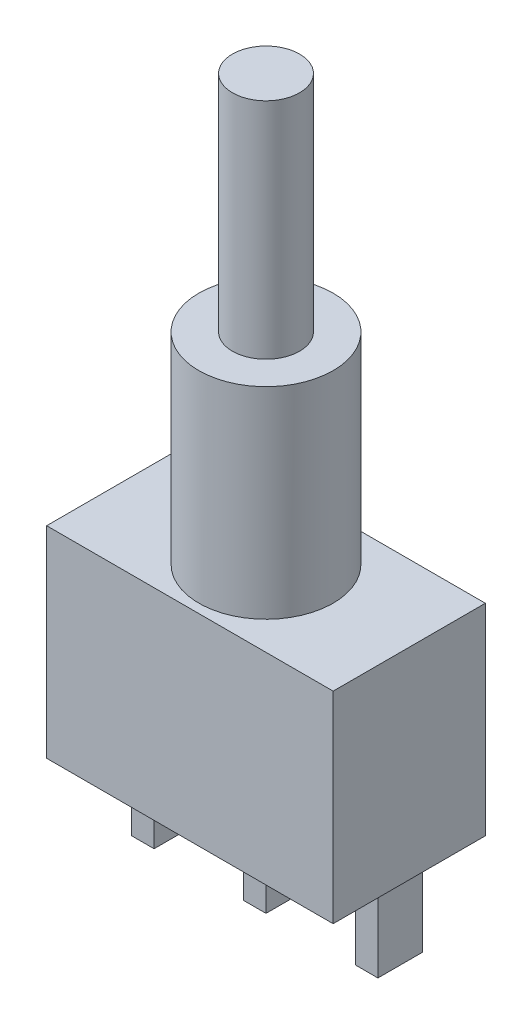
ISO-10303-21;
HEADER;
FILE_DESCRIPTION(('STEP AP214'),'2;1');
FILE_NAME('part.step','',(''),(''),'','','');
FILE_SCHEMA(('AUTOMOTIVE_DESIGN { 1 0 10303 214 1 1 1 1 }'));
ENDSEC;
DATA;
#1=APPLICATION_CONTEXT('core data for automotive mechanical design processes');
#2=APPLICATION_PROTOCOL_DEFINITION('international standard','automotive_design',2000,#1);
#3=PRODUCT_CONTEXT('',#1,'mechanical');
#4=PRODUCT('Part','Part','',(#3));
#5=PRODUCT_RELATED_PRODUCT_CATEGORY('part','',(#4));
#6=PRODUCT_DEFINITION_FORMATION('','',#4);
#7=PRODUCT_DEFINITION_CONTEXT('part definition',#1,'design');
#8=PRODUCT_DEFINITION('design','',#6,#7);
#9=PRODUCT_DEFINITION_SHAPE('','',#8);
#10=(LENGTH_UNIT() NAMED_UNIT(*) SI_UNIT(.MILLI.,.METRE.));
#11=(NAMED_UNIT(*) PLANE_ANGLE_UNIT() SI_UNIT($,.RADIAN.));
#12=(NAMED_UNIT(*) SI_UNIT($,.STERADIAN.) SOLID_ANGLE_UNIT());
#13=UNCERTAINTY_MEASURE_WITH_UNIT(LENGTH_MEASURE(1.E-05),#10,'distance_accuracy_value','');
#14=(GEOMETRIC_REPRESENTATION_CONTEXT(3) GLOBAL_UNCERTAINTY_ASSIGNED_CONTEXT((#13)) GLOBAL_UNIT_ASSIGNED_CONTEXT((#10,
#11,#12)) REPRESENTATION_CONTEXT('',''));
#15=CARTESIAN_POINT('',(0.,0.,0.));
#16=DIRECTION('',(0.,0.,1.));
#17=DIRECTION('',(1.,0.,0.));
#18=AXIS2_PLACEMENT_3D('',#15,#16,#17);
#19=CARTESIAN_POINT('',(6.4,18.,3.4));
#20=DIRECTION('',(0.,1.,0.));
#21=DIRECTION('',(0.,0.,1.));
#22=AXIS2_PLACEMENT_3D('',#19,#20,#21);
#23=PLANE('',#22);
#24=CARTESIAN_POINT('',(6.4,18.,3.4));
#25=DIRECTION('',(0.,1.,0.));
#26=DIRECTION('',(0.,0.,1.));
#27=AXIS2_PLACEMENT_3D('',#24,#25,#26);
#28=CIRCLE('',#27,3.);
#29=CARTESIAN_POINT('',(6.4,18.,6.4));
#30=VERTEX_POINT('',#29);
#31=EDGE_CURVE('E378',#30,#30,#28,.T.);
#32=ORIENTED_EDGE('',*,*,#31,.T.);
#33=EDGE_LOOP('',(#32));
#34=FACE_BOUND('',#33,.T.);
#35=CARTESIAN_POINT('',(6.4,18.,3.4));
#36=DIRECTION('',(0.,1.,0.));
#37=DIRECTION('',(0.,0.,1.));
#38=AXIS2_PLACEMENT_3D('',#35,#36,#37);
#39=CIRCLE('',#38,1.5);
#40=CARTESIAN_POINT('',(6.4,18.,4.9));
#41=VERTEX_POINT('',#40);
#42=EDGE_CURVE('E392',#41,#41,#39,.T.);
#43=ORIENTED_EDGE('',*,*,#42,.F.);
#44=EDGE_LOOP('',(#43));
#45=FACE_BOUND('',#44,.T.);
#46=ADVANCED_FACE('F33',(#34,#45),#23,.T.);
#47=CARTESIAN_POINT('',(0.,9.,6.8));
#48=DIRECTION('',(0.,-1.,0.));
#49=DIRECTION('',(0.,0.,-1.));
#50=AXIS2_PLACEMENT_3D('',#47,#48,#49);
#51=PLANE('',#50);
#52=DIRECTION('',(-1.,0.,0.));
#53=VECTOR('',#52,1.);
#54=CARTESIAN_POINT('',(0.,9.,0.));
#55=LINE('',#54,#53);
#56=CARTESIAN_POINT('',(12.8,9.,0.));
#57=VERTEX_POINT('',#56);
#58=CARTESIAN_POINT('',(0.,9.,0.));
#59=VERTEX_POINT('',#58);
#60=EDGE_CURVE('E243',#57,#59,#55,.T.);
#61=ORIENTED_EDGE('',*,*,#60,.T.);
#62=DIRECTION('',(0.,0.,-1.));
#63=VECTOR('',#62,1.);
#64=CARTESIAN_POINT('',(0.,9.,6.8));
#65=LINE('',#64,#63);
#66=CARTESIAN_POINT('',(0.,9.,6.8));
#67=VERTEX_POINT('',#66);
#68=EDGE_CURVE('E249',#67,#59,#65,.T.);
#69=ORIENTED_EDGE('',*,*,#68,.F.);
#70=DIRECTION('',(-1.,0.,0.));
#71=VECTOR('',#70,1.);
#72=CARTESIAN_POINT('',(0.,9.,6.8));
#73=LINE('',#72,#71);
#74=CARTESIAN_POINT('',(12.8,9.,6.8));
#75=VERTEX_POINT('',#74);
#76=EDGE_CURVE('E247',#75,#67,#73,.T.);
#77=ORIENTED_EDGE('',*,*,#76,.F.);
#78=DIRECTION('',(0.,0.,-1.));
#79=VECTOR('',#78,1.);
#80=CARTESIAN_POINT('',(12.8,9.,6.8));
#81=LINE('',#80,#79);
#82=EDGE_CURVE('E259',#75,#57,#81,.T.);
#83=ORIENTED_EDGE('',*,*,#82,.T.);
#84=EDGE_LOOP('',(#61,#69,#77,#83));
#85=FACE_BOUND('',#84,.T.);
#86=CARTESIAN_POINT('',(6.4,9.,3.4));
#87=DIRECTION('',(0.,-1.,0.));
#88=DIRECTION('',(0.,0.,-1.));
#89=AXIS2_PLACEMENT_3D('',#86,#87,#88);
#90=CIRCLE('',#89,3.);
#91=CARTESIAN_POINT('',(6.4,9.,0.399999999999999));
#92=VERTEX_POINT('',#91);
#93=EDGE_CURVE('E11',#92,#92,#90,.F.);
#94=ORIENTED_EDGE('',*,*,#93,.F.);
#95=EDGE_LOOP('',(#94));
#96=FACE_BOUND('',#95,.T.);
#97=ADVANCED_FACE('F284',(#85,#96),#51,.F.);
#98=CARTESIAN_POINT('',(0.,0.,6.8));
#99=DIRECTION('',(0.,1.,0.));
#100=DIRECTION('',(0.,0.,1.));
#101=AXIS2_PLACEMENT_3D('',#98,#99,#100);
#102=PLANE('',#101);
#103=DIRECTION('',(1.,0.,0.));
#104=VECTOR('',#103,1.);
#105=CARTESIAN_POINT('',(5.9,0.,1.9));
#106=LINE('',#105,#104);
#107=CARTESIAN_POINT('',(5.9,0.,1.9));
#108=VERTEX_POINT('',#107);
#109=CARTESIAN_POINT('',(6.9,0.,1.9));
#110=VERTEX_POINT('',#109);
#111=EDGE_CURVE('E167',#108,#110,#106,.T.);
#112=ORIENTED_EDGE('',*,*,#111,.F.);
#113=DIRECTION('',(0.,0.,-1.));
#114=VECTOR('',#113,1.);
#115=CARTESIAN_POINT('',(5.9,0.,1.9));
#116=LINE('',#115,#114);
#117=CARTESIAN_POINT('',(5.9,0.,3.9));
#118=VERTEX_POINT('',#117);
#119=EDGE_CURVE('E180',#118,#108,#116,.T.);
#120=ORIENTED_EDGE('',*,*,#119,.F.);
#121=DIRECTION('',(-1.,0.,0.));
#122=VECTOR('',#121,1.);
#123=CARTESIAN_POINT('',(5.9,0.,3.9));
#124=LINE('',#123,#122);
#125=CARTESIAN_POINT('',(6.9,0.,3.9));
#126=VERTEX_POINT('',#125);
#127=EDGE_CURVE('E189',#126,#118,#124,.T.);
#128=ORIENTED_EDGE('',*,*,#127,.F.);
#129=DIRECTION('',(0.,0.,1.));
#130=VECTOR('',#129,1.);
#131=CARTESIAN_POINT('',(6.9,0.,1.9));
#132=LINE('',#131,#130);
#133=EDGE_CURVE('E170',#110,#126,#132,.T.);
#134=ORIENTED_EDGE('',*,*,#133,.F.);
#135=EDGE_LOOP('',(#112,#120,#128,#134));
#136=FACE_BOUND('',#135,.T.);
#137=DIRECTION('',(1.,0.,0.));
#138=VECTOR('',#137,1.);
#139=CARTESIAN_POINT('',(0.,0.,0.));
#140=LINE('',#139,#138);
#141=CARTESIAN_POINT('',(0.,0.,0.));
#142=VERTEX_POINT('',#141);
#143=CARTESIAN_POINT('',(12.8,0.,0.));
#144=VERTEX_POINT('',#143);
#145=EDGE_CURVE('E252',#142,#144,#140,.T.);
#146=ORIENTED_EDGE('',*,*,#145,.T.);
#147=DIRECTION('',(0.,0.,-1.));
#148=VECTOR('',#147,1.);
#149=CARTESIAN_POINT('',(12.8,0.,6.8));
#150=LINE('',#149,#148);
#151=CARTESIAN_POINT('',(12.8,0.,6.8));
#152=VERTEX_POINT('',#151);
#153=EDGE_CURVE('E262',#152,#144,#150,.T.);
#154=ORIENTED_EDGE('',*,*,#153,.F.);
#155=DIRECTION('',(1.,0.,0.));
#156=VECTOR('',#155,1.);
#157=CARTESIAN_POINT('',(0.,0.,6.8));
#158=LINE('',#157,#156);
#159=CARTESIAN_POINT('',(0.,0.,6.8));
#160=VERTEX_POINT('',#159);
#161=EDGE_CURVE('E242',#160,#152,#158,.T.);
#162=ORIENTED_EDGE('',*,*,#161,.F.);
#163=DIRECTION('',(0.,0.,-1.));
#164=VECTOR('',#163,1.);
#165=CARTESIAN_POINT('',(0.,0.,6.8));
#166=LINE('',#165,#164);
#167=EDGE_CURVE('E41',#160,#142,#166,.T.);
#168=ORIENTED_EDGE('',*,*,#167,.T.);
#169=EDGE_LOOP('',(#146,#154,#162,#168));
#170=FACE_BOUND('',#169,.T.);
#171=DIRECTION('',(0.,0.,-1.));
#172=VECTOR('',#171,1.);
#173=CARTESIAN_POINT('',(0.899999999999999,0.,1.9));
#174=LINE('',#173,#172);
#175=CARTESIAN_POINT('',(0.899999999999999,0.,3.9));
#176=VERTEX_POINT('',#175);
#177=CARTESIAN_POINT('',(0.899999999999999,0.,1.9));
#178=VERTEX_POINT('',#177);
#179=EDGE_CURVE('E205',#176,#178,#174,.T.);
#180=ORIENTED_EDGE('',*,*,#179,.F.);
#181=DIRECTION('',(-1.,0.,0.));
#182=VECTOR('',#181,1.);
#183=CARTESIAN_POINT('',(0.899999999999999,0.,3.9));
#184=LINE('',#183,#182);
#185=CARTESIAN_POINT('',(1.9,0.,3.9));
#186=VERTEX_POINT('',#185);
#187=EDGE_CURVE('E210',#186,#176,#184,.T.);
#188=ORIENTED_EDGE('',*,*,#187,.F.);
#189=DIRECTION('',(0.,0.,1.));
#190=VECTOR('',#189,1.);
#191=CARTESIAN_POINT('',(1.9,0.,1.9));
#192=LINE('',#191,#190);
#193=CARTESIAN_POINT('',(1.9,0.,1.9));
#194=VERTEX_POINT('',#193);
#195=EDGE_CURVE('E222',#194,#186,#192,.T.);
#196=ORIENTED_EDGE('',*,*,#195,.F.);
#197=DIRECTION('',(1.,0.,0.));
#198=VECTOR('',#197,1.);
#199=CARTESIAN_POINT('',(0.899999999999999,0.,1.9));
#200=LINE('',#199,#198);
#201=EDGE_CURVE('E219',#178,#194,#200,.T.);
#202=ORIENTED_EDGE('',*,*,#201,.F.);
#203=EDGE_LOOP('',(#180,#188,#196,#202));
#204=FACE_BOUND('',#203,.T.);
#205=DIRECTION('',(1.,0.,0.));
#206=VECTOR('',#205,1.);
#207=CARTESIAN_POINT('',(10.9,0.,1.9));
#208=LINE('',#207,#206);
#209=CARTESIAN_POINT('',(10.9,0.,1.9));
#210=VERTEX_POINT('',#209);
#211=CARTESIAN_POINT('',(11.9,0.,1.9));
#212=VERTEX_POINT('',#211);
#213=EDGE_CURVE('E166',#210,#212,#208,.T.);
#214=ORIENTED_EDGE('',*,*,#213,.F.);
#215=DIRECTION('',(0.,0.,-1.));
#216=VECTOR('',#215,1.);
#217=CARTESIAN_POINT('',(10.9,0.,1.9));
#218=LINE('',#217,#216);
#219=CARTESIAN_POINT('',(10.9,0.,3.9));
#220=VERTEX_POINT('',#219);
#221=EDGE_CURVE('E163',#220,#210,#218,.T.);
#222=ORIENTED_EDGE('',*,*,#221,.F.);
#223=DIRECTION('',(-1.,0.,0.));
#224=VECTOR('',#223,1.);
#225=CARTESIAN_POINT('',(10.9,0.,3.9));
#226=LINE('',#225,#224);
#227=CARTESIAN_POINT('',(11.9,0.,3.9));
#228=VERTEX_POINT('',#227);
#229=EDGE_CURVE('E53',#228,#220,#226,.T.);
#230=ORIENTED_EDGE('',*,*,#229,.F.);
#231=DIRECTION('',(0.,0.,1.));
#232=VECTOR('',#231,1.);
#233=CARTESIAN_POINT('',(11.9,0.,1.9));
#234=LINE('',#233,#232);
#235=EDGE_CURVE('E48',#212,#228,#234,.T.);
#236=ORIENTED_EDGE('',*,*,#235,.F.);
#237=EDGE_LOOP('',(#214,#222,#230,#236));
#238=FACE_BOUND('',#237,.T.);
#239=ADVANCED_FACE('F267',(#136,#170,#204,#238),#102,.F.);
#240=CARTESIAN_POINT('',(0.,0.,6.8));
#241=DIRECTION('',(1.,0.,0.));
#242=DIRECTION('',(0.,0.,-1.));
#243=AXIS2_PLACEMENT_3D('',#240,#241,#242);
#244=PLANE('',#243);
#245=DIRECTION('',(0.,-1.,0.));
#246=VECTOR('',#245,1.);
#247=CARTESIAN_POINT('',(0.,0.,0.));
#248=LINE('',#247,#246);
#249=EDGE_CURVE('E238',#59,#142,#248,.T.);
#250=ORIENTED_EDGE('',*,*,#249,.T.);
#251=ORIENTED_EDGE('',*,*,#167,.F.);
#252=DIRECTION('',(0.,-1.,0.));
#253=VECTOR('',#252,1.);
#254=CARTESIAN_POINT('',(0.,0.,6.8));
#255=LINE('',#254,#253);
#256=EDGE_CURVE('E239',#67,#160,#255,.T.);
#257=ORIENTED_EDGE('',*,*,#256,.F.);
#258=ORIENTED_EDGE('',*,*,#68,.T.);
#259=EDGE_LOOP('',(#250,#251,#257,#258));
#260=FACE_BOUND('',#259,.T.);
#261=ADVANCED_FACE('F35',(#260),#244,.F.);
#262=CARTESIAN_POINT('',(12.8,0.,6.8));
#263=DIRECTION('',(-1.,0.,0.));
#264=DIRECTION('',(0.,0.,1.));
#265=AXIS2_PLACEMENT_3D('',#262,#263,#264);
#266=PLANE('',#265);
#267=DIRECTION('',(0.,1.,0.));
#268=VECTOR('',#267,1.);
#269=CARTESIAN_POINT('',(12.8,0.,0.));
#270=LINE('',#269,#268);
#271=EDGE_CURVE('E254',#144,#57,#270,.T.);
#272=ORIENTED_EDGE('',*,*,#271,.T.);
#273=ORIENTED_EDGE('',*,*,#82,.F.);
#274=DIRECTION('',(0.,1.,0.));
#275=VECTOR('',#274,1.);
#276=CARTESIAN_POINT('',(12.8,0.,6.8));
#277=LINE('',#276,#275);
#278=EDGE_CURVE('E245',#152,#75,#277,.T.);
#279=ORIENTED_EDGE('',*,*,#278,.F.);
#280=ORIENTED_EDGE('',*,*,#153,.T.);
#281=EDGE_LOOP('',(#272,#273,#279,#280));
#282=FACE_BOUND('',#281,.T.);
#283=ADVANCED_FACE('F280',(#282),#266,.F.);
#284=CARTESIAN_POINT('',(0.,0.,6.8));
#285=DIRECTION('',(0.,0.,-1.));
#286=DIRECTION('',(-1.,0.,0.));
#287=AXIS2_PLACEMENT_3D('',#284,#285,#286);
#288=PLANE('',#287);
#289=ORIENTED_EDGE('',*,*,#256,.T.);
#290=ORIENTED_EDGE('',*,*,#161,.T.);
#291=ORIENTED_EDGE('',*,*,#278,.T.);
#292=ORIENTED_EDGE('',*,*,#76,.T.);
#293=EDGE_LOOP('',(#289,#290,#291,#292));
#294=FACE_BOUND('',#293,.T.);
#295=ADVANCED_FACE('F287',(#294),#288,.F.);
#296=CARTESIAN_POINT('',(0.,0.,0.));
#297=DIRECTION('',(0.,0.,-1.));
#298=DIRECTION('',(-1.,0.,0.));
#299=AXIS2_PLACEMENT_3D('',#296,#297,#298);
#300=PLANE('',#299);
#301=ORIENTED_EDGE('',*,*,#249,.F.);
#302=ORIENTED_EDGE('',*,*,#60,.F.);
#303=ORIENTED_EDGE('',*,*,#271,.F.);
#304=ORIENTED_EDGE('',*,*,#145,.F.);
#305=EDGE_LOOP('',(#301,#302,#303,#304));
#306=FACE_BOUND('',#305,.T.);
#307=ADVANCED_FACE('F276',(#306),#300,.T.);
#308=CARTESIAN_POINT('',(0.899999999999999,-4.,1.9));
#309=DIRECTION('',(1.,0.,0.));
#310=DIRECTION('',(0.,0.,-1.));
#311=AXIS2_PLACEMENT_3D('',#308,#309,#310);
#312=PLANE('',#311);
#313=ORIENTED_EDGE('',*,*,#179,.T.);
#314=DIRECTION('',(0.,1.,0.));
#315=VECTOR('',#314,1.);
#316=CARTESIAN_POINT('',(0.899999999999999,-4.,1.9));
#317=LINE('',#316,#315);
#318=CARTESIAN_POINT('',(0.899999999999999,-4.,1.9));
#319=VERTEX_POINT('',#318);
#320=EDGE_CURVE('E235',#319,#178,#317,.T.);
#321=ORIENTED_EDGE('',*,*,#320,.F.);
#322=DIRECTION('',(0.,0.,-1.));
#323=VECTOR('',#322,1.);
#324=CARTESIAN_POINT('',(0.899999999999999,-4.,1.9));
#325=LINE('',#324,#323);
#326=CARTESIAN_POINT('',(0.899999999999999,-4.,3.9));
#327=VERTEX_POINT('',#326);
#328=EDGE_CURVE('E206',#327,#319,#325,.T.);
#329=ORIENTED_EDGE('',*,*,#328,.F.);
#330=DIRECTION('',(0.,1.,0.));
#331=VECTOR('',#330,1.);
#332=CARTESIAN_POINT('',(0.899999999999999,-4.,3.9));
#333=LINE('',#332,#331);
#334=EDGE_CURVE('E216',#327,#176,#333,.T.);
#335=ORIENTED_EDGE('',*,*,#334,.T.);
#336=EDGE_LOOP('',(#313,#321,#329,#335));
#337=FACE_BOUND('',#336,.T.);
#338=ADVANCED_FACE('F294',(#337),#312,.F.);
#339=CARTESIAN_POINT('',(0.899999999999999,-4.,1.9));
#340=DIRECTION('',(0.,0.,1.));
#341=DIRECTION('',(1.,0.,0.));
#342=AXIS2_PLACEMENT_3D('',#339,#340,#341);
#343=PLANE('',#342);
#344=ORIENTED_EDGE('',*,*,#201,.T.);
#345=DIRECTION('',(0.,1.,0.));
#346=VECTOR('',#345,1.);
#347=CARTESIAN_POINT('',(1.9,-4.,1.9));
#348=LINE('',#347,#346);
#349=CARTESIAN_POINT('',(1.9,-4.,1.9));
#350=VERTEX_POINT('',#349);
#351=EDGE_CURVE('E232',#350,#194,#348,.T.);
#352=ORIENTED_EDGE('',*,*,#351,.F.);
#353=DIRECTION('',(1.,0.,0.));
#354=VECTOR('',#353,1.);
#355=CARTESIAN_POINT('',(0.899999999999999,-4.,1.9));
#356=LINE('',#355,#354);
#357=EDGE_CURVE('E209',#319,#350,#356,.T.);
#358=ORIENTED_EDGE('',*,*,#357,.F.);
#359=ORIENTED_EDGE('',*,*,#320,.T.);
#360=EDGE_LOOP('',(#344,#352,#358,#359));
#361=FACE_BOUND('',#360,.T.);
#362=ADVANCED_FACE('F360',(#361),#343,.F.);
#363=CARTESIAN_POINT('',(1.9,-4.,1.9));
#364=DIRECTION('',(-1.,0.,0.));
#365=DIRECTION('',(0.,0.,1.));
#366=AXIS2_PLACEMENT_3D('',#363,#364,#365);
#367=PLANE('',#366);
#368=ORIENTED_EDGE('',*,*,#195,.T.);
#369=DIRECTION('',(0.,1.,0.));
#370=VECTOR('',#369,1.);
#371=CARTESIAN_POINT('',(1.9,-4.,3.9));
#372=LINE('',#371,#370);
#373=CARTESIAN_POINT('',(1.9,-4.,3.9));
#374=VERTEX_POINT('',#373);
#375=EDGE_CURVE('E229',#374,#186,#372,.T.);
#376=ORIENTED_EDGE('',*,*,#375,.F.);
#377=DIRECTION('',(0.,0.,1.));
#378=VECTOR('',#377,1.);
#379=CARTESIAN_POINT('',(1.9,-4.,1.9));
#380=LINE('',#379,#378);
#381=EDGE_CURVE('E212',#350,#374,#380,.T.);
#382=ORIENTED_EDGE('',*,*,#381,.F.);
#383=ORIENTED_EDGE('',*,*,#351,.T.);
#384=EDGE_LOOP('',(#368,#376,#382,#383));
#385=FACE_BOUND('',#384,.T.);
#386=ADVANCED_FACE('F356',(#385),#367,.F.);
#387=CARTESIAN_POINT('',(0.899999999999999,-4.,3.9));
#388=DIRECTION('',(0.,0.,-1.));
#389=DIRECTION('',(-1.,0.,0.));
#390=AXIS2_PLACEMENT_3D('',#387,#388,#389);
#391=PLANE('',#390);
#392=ORIENTED_EDGE('',*,*,#187,.T.);
#393=ORIENTED_EDGE('',*,*,#334,.F.);
#394=DIRECTION('',(-1.,0.,0.));
#395=VECTOR('',#394,1.);
#396=CARTESIAN_POINT('',(0.899999999999999,-4.,3.9));
#397=LINE('',#396,#395);
#398=EDGE_CURVE('E214',#374,#327,#397,.T.);
#399=ORIENTED_EDGE('',*,*,#398,.F.);
#400=ORIENTED_EDGE('',*,*,#375,.T.);
#401=EDGE_LOOP('',(#392,#393,#399,#400));
#402=FACE_BOUND('',#401,.T.);
#403=ADVANCED_FACE('F352',(#402),#391,.F.);
#404=CARTESIAN_POINT('',(0.,-4.,0.));
#405=DIRECTION('',(0.,1.,0.));
#406=DIRECTION('',(0.,0.,1.));
#407=AXIS2_PLACEMENT_3D('',#404,#405,#406);
#408=PLANE('',#407);
#409=ORIENTED_EDGE('',*,*,#328,.T.);
#410=ORIENTED_EDGE('',*,*,#357,.T.);
#411=ORIENTED_EDGE('',*,*,#381,.T.);
#412=ORIENTED_EDGE('',*,*,#398,.T.);
#413=EDGE_LOOP('',(#409,#410,#411,#412));
#414=FACE_BOUND('',#413,.T.);
#415=ADVANCED_FACE('F348',(#414),#408,.F.);
#416=CARTESIAN_POINT('',(5.9,-4.,1.9));
#417=DIRECTION('',(0.,0.,1.));
#418=DIRECTION('',(1.,0.,0.));
#419=AXIS2_PLACEMENT_3D('',#416,#417,#418);
#420=PLANE('',#419);
#421=ORIENTED_EDGE('',*,*,#111,.T.);
#422=DIRECTION('',(0.,1.,0.));
#423=VECTOR('',#422,1.);
#424=CARTESIAN_POINT('',(6.9,-4.,1.9));
#425=LINE('',#424,#423);
#426=CARTESIAN_POINT('',(6.9,-4.,1.9));
#427=VERTEX_POINT('',#426);
#428=EDGE_CURVE('E202',#427,#110,#425,.T.);
#429=ORIENTED_EDGE('',*,*,#428,.F.);
#430=DIRECTION('',(1.,0.,0.));
#431=VECTOR('',#430,1.);
#432=CARTESIAN_POINT('',(5.9,-4.,1.9));
#433=LINE('',#432,#431);
#434=CARTESIAN_POINT('',(5.9,-4.,1.9));
#435=VERTEX_POINT('',#434);
#436=EDGE_CURVE('E176',#435,#427,#433,.T.);
#437=ORIENTED_EDGE('',*,*,#436,.F.);
#438=DIRECTION('',(0.,1.,0.));
#439=VECTOR('',#438,1.);
#440=CARTESIAN_POINT('',(5.9,-4.,1.9));
#441=LINE('',#440,#439);
#442=EDGE_CURVE('E185',#435,#108,#441,.T.);
#443=ORIENTED_EDGE('',*,*,#442,.T.);
#444=EDGE_LOOP('',(#421,#429,#437,#443));
#445=FACE_BOUND('',#444,.T.);
#446=ADVANCED_FACE('F344',(#445),#420,.F.);
#447=CARTESIAN_POINT('',(6.9,-4.,1.9));
#448=DIRECTION('',(-1.,0.,0.));
#449=DIRECTION('',(0.,0.,1.));
#450=AXIS2_PLACEMENT_3D('',#447,#448,#449);
#451=PLANE('',#450);
#452=ORIENTED_EDGE('',*,*,#133,.T.);
#453=DIRECTION('',(0.,1.,0.));
#454=VECTOR('',#453,1.);
#455=CARTESIAN_POINT('',(6.9,-4.,3.9));
#456=LINE('',#455,#454);
#457=CARTESIAN_POINT('',(6.9,-4.,3.9));
#458=VERTEX_POINT('',#457);
#459=EDGE_CURVE('E199',#458,#126,#456,.T.);
#460=ORIENTED_EDGE('',*,*,#459,.F.);
#461=DIRECTION('',(0.,0.,1.));
#462=VECTOR('',#461,1.);
#463=CARTESIAN_POINT('',(6.9,-4.,1.9));
#464=LINE('',#463,#462);
#465=EDGE_CURVE('E179',#427,#458,#464,.T.);
#466=ORIENTED_EDGE('',*,*,#465,.F.);
#467=ORIENTED_EDGE('',*,*,#428,.T.);
#468=EDGE_LOOP('',(#452,#460,#466,#467));
#469=FACE_BOUND('',#468,.T.);
#470=ADVANCED_FACE('F340',(#469),#451,.F.);
#471=CARTESIAN_POINT('',(5.9,-4.,3.9));
#472=DIRECTION('',(0.,0.,-1.));
#473=DIRECTION('',(-1.,0.,0.));
#474=AXIS2_PLACEMENT_3D('',#471,#472,#473);
#475=PLANE('',#474);
#476=ORIENTED_EDGE('',*,*,#127,.T.);
#477=DIRECTION('',(0.,1.,0.));
#478=VECTOR('',#477,1.);
#479=CARTESIAN_POINT('',(5.9,-4.,3.9));
#480=LINE('',#479,#478);
#481=CARTESIAN_POINT('',(5.9,-4.,3.9));
#482=VERTEX_POINT('',#481);
#483=EDGE_CURVE('E196',#482,#118,#480,.T.);
#484=ORIENTED_EDGE('',*,*,#483,.F.);
#485=DIRECTION('',(-1.,0.,0.));
#486=VECTOR('',#485,1.);
#487=CARTESIAN_POINT('',(5.9,-4.,3.9));
#488=LINE('',#487,#486);
#489=EDGE_CURVE('E182',#458,#482,#488,.T.);
#490=ORIENTED_EDGE('',*,*,#489,.F.);
#491=ORIENTED_EDGE('',*,*,#459,.T.);
#492=EDGE_LOOP('',(#476,#484,#490,#491));
#493=FACE_BOUND('',#492,.T.);
#494=ADVANCED_FACE('F336',(#493),#475,.F.);
#495=CARTESIAN_POINT('',(5.9,-4.,1.9));
#496=DIRECTION('',(1.,0.,0.));
#497=DIRECTION('',(0.,0.,-1.));
#498=AXIS2_PLACEMENT_3D('',#495,#496,#497);
#499=PLANE('',#498);
#500=ORIENTED_EDGE('',*,*,#119,.T.);
#501=ORIENTED_EDGE('',*,*,#442,.F.);
#502=DIRECTION('',(0.,0.,-1.));
#503=VECTOR('',#502,1.);
#504=CARTESIAN_POINT('',(5.9,-4.,1.9));
#505=LINE('',#504,#503);
#506=EDGE_CURVE('E184',#482,#435,#505,.T.);
#507=ORIENTED_EDGE('',*,*,#506,.F.);
#508=ORIENTED_EDGE('',*,*,#483,.T.);
#509=EDGE_LOOP('',(#500,#501,#507,#508));
#510=FACE_BOUND('',#509,.T.);
#511=ADVANCED_FACE('F332',(#510),#499,.F.);
#512=CARTESIAN_POINT('',(0.,-4.,0.));
#513=DIRECTION('',(0.,-1.,0.));
#514=DIRECTION('',(0.,0.,-1.));
#515=AXIS2_PLACEMENT_3D('',#512,#513,#514);
#516=PLANE('',#515);
#517=ORIENTED_EDGE('',*,*,#436,.T.);
#518=ORIENTED_EDGE('',*,*,#465,.T.);
#519=ORIENTED_EDGE('',*,*,#489,.T.);
#520=ORIENTED_EDGE('',*,*,#506,.T.);
#521=EDGE_LOOP('',(#517,#518,#519,#520));
#522=FACE_BOUND('',#521,.T.);
#523=ADVANCED_FACE('F329',(#522),#516,.T.);
#524=CARTESIAN_POINT('',(10.9,-4.,1.9));
#525=DIRECTION('',(0.,0.,1.));
#526=DIRECTION('',(1.,0.,0.));
#527=AXIS2_PLACEMENT_3D('',#524,#525,#526);
#528=PLANE('',#527);
#529=ORIENTED_EDGE('',*,*,#213,.T.);
#530=DIRECTION('',(0.,1.,0.));
#531=VECTOR('',#530,1.);
#532=CARTESIAN_POINT('',(11.9,-4.,1.9));
#533=LINE('',#532,#531);
#534=CARTESIAN_POINT('',(11.9,-4.,1.9));
#535=VERTEX_POINT('',#534);
#536=EDGE_CURVE('E147',#535,#212,#533,.T.);
#537=ORIENTED_EDGE('',*,*,#536,.F.);
#538=DIRECTION('',(1.,0.,0.));
#539=VECTOR('',#538,1.);
#540=CARTESIAN_POINT('',(10.9,-4.,1.9));
#541=LINE('',#540,#539);
#542=CARTESIAN_POINT('',(10.9,-4.,1.9));
#543=VERTEX_POINT('',#542);
#544=EDGE_CURVE('E154',#543,#535,#541,.T.);
#545=ORIENTED_EDGE('',*,*,#544,.F.);
#546=DIRECTION('',(0.,1.,0.));
#547=VECTOR('',#546,1.);
#548=CARTESIAN_POINT('',(10.9,-4.,1.9));
#549=LINE('',#548,#547);
#550=EDGE_CURVE('E381',#543,#210,#549,.T.);
#551=ORIENTED_EDGE('',*,*,#550,.T.);
#552=EDGE_LOOP('',(#529,#537,#545,#551));
#553=FACE_BOUND('',#552,.T.);
#554=ADVANCED_FACE('F165',(#553),#528,.F.);
#555=CARTESIAN_POINT('',(11.9,-4.,1.9));
#556=DIRECTION('',(-1.,0.,0.));
#557=DIRECTION('',(0.,0.,1.));
#558=AXIS2_PLACEMENT_3D('',#555,#556,#557);
#559=PLANE('',#558);
#560=ORIENTED_EDGE('',*,*,#235,.T.);
#561=DIRECTION('',(0.,1.,0.));
#562=VECTOR('',#561,1.);
#563=CARTESIAN_POINT('',(11.9,-4.,3.9));
#564=LINE('',#563,#562);
#565=CARTESIAN_POINT('',(11.9,-4.,3.9));
#566=VERTEX_POINT('',#565);
#567=EDGE_CURVE('E150',#566,#228,#564,.T.);
#568=ORIENTED_EDGE('',*,*,#567,.F.);
#569=DIRECTION('',(0.,0.,1.));
#570=VECTOR('',#569,1.);
#571=CARTESIAN_POINT('',(11.9,-4.,1.9));
#572=LINE('',#571,#570);
#573=EDGE_CURVE('E143',#535,#566,#572,.T.);
#574=ORIENTED_EDGE('',*,*,#573,.F.);
#575=ORIENTED_EDGE('',*,*,#536,.T.);
#576=EDGE_LOOP('',(#560,#568,#574,#575));
#577=FACE_BOUND('',#576,.T.);
#578=ADVANCED_FACE('F145',(#577),#559,.F.);
#579=CARTESIAN_POINT('',(10.9,-4.,3.9));
#580=DIRECTION('',(0.,0.,-1.));
#581=DIRECTION('',(-1.,0.,0.));
#582=AXIS2_PLACEMENT_3D('',#579,#580,#581);
#583=PLANE('',#582);
#584=ORIENTED_EDGE('',*,*,#229,.T.);
#585=DIRECTION('',(0.,1.,0.));
#586=VECTOR('',#585,1.);
#587=CARTESIAN_POINT('',(10.9,-4.,3.9));
#588=LINE('',#587,#586);
#589=CARTESIAN_POINT('',(10.9,-4.,3.9));
#590=VERTEX_POINT('',#589);
#591=EDGE_CURVE('E172',#590,#220,#588,.T.);
#592=ORIENTED_EDGE('',*,*,#591,.F.);
#593=DIRECTION('',(-1.,0.,0.));
#594=VECTOR('',#593,1.);
#595=CARTESIAN_POINT('',(10.9,-4.,3.9));
#596=LINE('',#595,#594);
#597=EDGE_CURVE('E153',#566,#590,#596,.T.);
#598=ORIENTED_EDGE('',*,*,#597,.F.);
#599=ORIENTED_EDGE('',*,*,#567,.T.);
#600=EDGE_LOOP('',(#584,#592,#598,#599));
#601=FACE_BOUND('',#600,.T.);
#602=ADVANCED_FACE('F320',(#601),#583,.F.);
#603=CARTESIAN_POINT('',(10.9,-4.,1.9));
#604=DIRECTION('',(1.,0.,0.));
#605=DIRECTION('',(0.,0.,-1.));
#606=AXIS2_PLACEMENT_3D('',#603,#604,#605);
#607=PLANE('',#606);
#608=ORIENTED_EDGE('',*,*,#221,.T.);
#609=ORIENTED_EDGE('',*,*,#550,.F.);
#610=DIRECTION('',(0.,0.,-1.));
#611=VECTOR('',#610,1.);
#612=CARTESIAN_POINT('',(10.9,-4.,1.9));
#613=LINE('',#612,#611);
#614=EDGE_CURVE('E159',#590,#543,#613,.T.);
#615=ORIENTED_EDGE('',*,*,#614,.F.);
#616=ORIENTED_EDGE('',*,*,#591,.T.);
#617=EDGE_LOOP('',(#608,#609,#615,#616));
#618=FACE_BOUND('',#617,.T.);
#619=ADVANCED_FACE('F317',(#618),#607,.F.);
#620=CARTESIAN_POINT('',(0.,-4.,0.));
#621=DIRECTION('',(0.,-1.,0.));
#622=DIRECTION('',(0.,0.,-1.));
#623=AXIS2_PLACEMENT_3D('',#620,#621,#622);
#624=PLANE('',#623);
#625=ORIENTED_EDGE('',*,*,#544,.T.);
#626=ORIENTED_EDGE('',*,*,#573,.T.);
#627=ORIENTED_EDGE('',*,*,#597,.T.);
#628=ORIENTED_EDGE('',*,*,#614,.T.);
#629=EDGE_LOOP('',(#625,#626,#627,#628));
#630=FACE_BOUND('',#629,.T.);
#631=ADVANCED_FACE('F157',(#630),#624,.T.);
#632=CARTESIAN_POINT('',(6.4,18.,3.4));
#633=DIRECTION('',(0.,-1.,0.));
#634=DIRECTION('',(0.,0.,-1.));
#635=AXIS2_PLACEMENT_3D('',#632,#633,#634);
#636=CYLINDRICAL_SURFACE('',#635,3.);
#637=ORIENTED_EDGE('',*,*,#31,.F.);
#638=EDGE_LOOP('',(#637));
#639=FACE_BOUND('',#638,.T.);
#640=ORIENTED_EDGE('',*,*,#93,.T.);
#641=EDGE_LOOP('',(#640));
#642=FACE_BOUND('',#641,.T.);
#643=ADVANCED_FACE('F311',(#639,#642),#636,.T.);
#644=CARTESIAN_POINT('',(6.4,28.,3.4));
#645=DIRECTION('',(0.,-1.,0.));
#646=DIRECTION('',(0.,0.,-1.));
#647=AXIS2_PLACEMENT_3D('',#644,#645,#646);
#648=CYLINDRICAL_SURFACE('',#647,1.5);
#649=CARTESIAN_POINT('',(6.4,28.,3.4));
#650=DIRECTION('',(0.,1.,0.));
#651=DIRECTION('',(0.,0.,1.));
#652=AXIS2_PLACEMENT_3D('',#649,#650,#651);
#653=CIRCLE('',#652,1.5);
#654=CARTESIAN_POINT('',(6.4,28.,4.9));
#655=VERTEX_POINT('',#654);
#656=EDGE_CURVE('E391',#655,#655,#653,.T.);
#657=ORIENTED_EDGE('',*,*,#656,.F.);
#658=EDGE_LOOP('',(#657));
#659=FACE_BOUND('',#658,.T.);
#660=ORIENTED_EDGE('',*,*,#42,.T.);
#661=EDGE_LOOP('',(#660));
#662=FACE_BOUND('',#661,.T.);
#663=ADVANCED_FACE('F309',(#659,#662),#648,.T.);
#664=CARTESIAN_POINT('',(6.4,28.,3.4));
#665=DIRECTION('',(0.,1.,0.));
#666=DIRECTION('',(0.,0.,1.));
#667=AXIS2_PLACEMENT_3D('',#664,#665,#666);
#668=PLANE('',#667);
#669=ORIENTED_EDGE('',*,*,#656,.T.);
#670=EDGE_LOOP('',(#669));
#671=FACE_BOUND('',#670,.T.);
#672=ADVANCED_FACE('F398',(#671),#668,.T.);
#673=CLOSED_SHELL('',(#46,#97,#239,#261,#283,#295,#307,#338,#362,#386,#403,#415,#446,#470,#494,
#511,#523,#554,#578,#602,#619,#631,#643,#663,#672));
#674=MANIFOLD_SOLID_BREP('B2',#673);
#675=ADVANCED_BREP_SHAPE_REPRESENTATION('',(#18,#674),#14);
#676=SHAPE_DEFINITION_REPRESENTATION(#9,#675);
ENDSEC;
END-ISO-10303-21;
